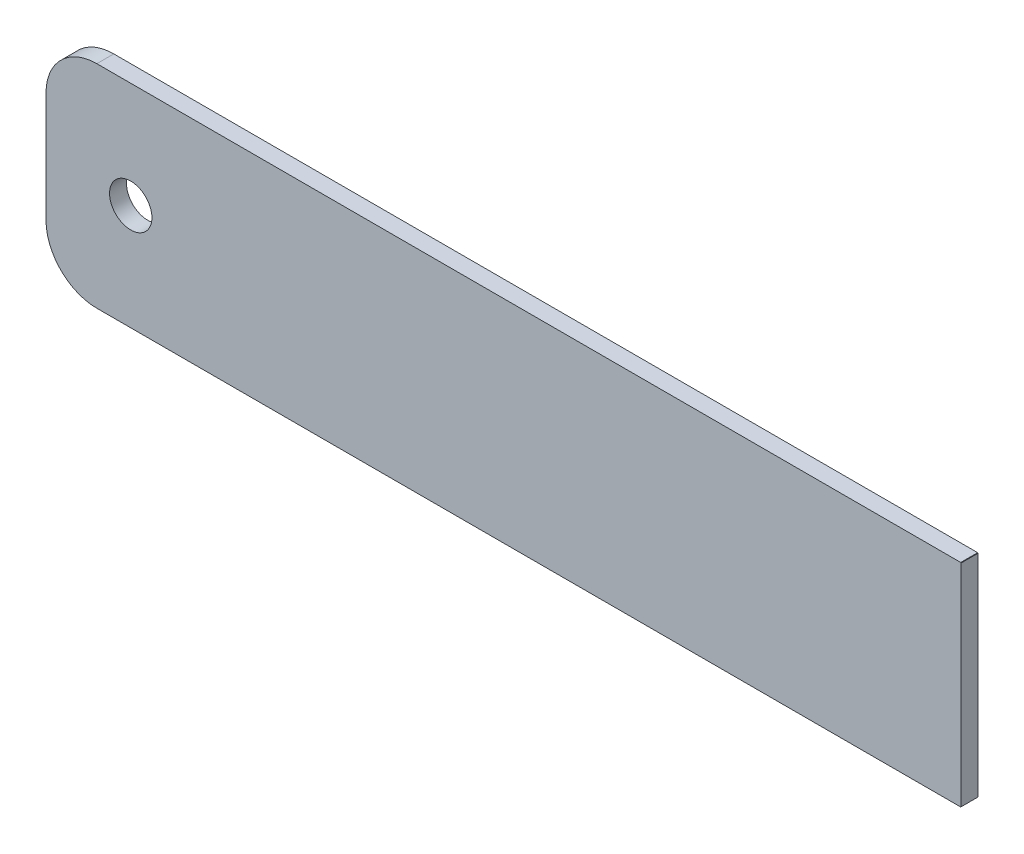
ISO-10303-21;
HEADER;
FILE_DESCRIPTION(('STEP AP214'),'2;1');
FILE_NAME('part.step','',(''),(''),'','','');
FILE_SCHEMA(('AUTOMOTIVE_DESIGN { 1 0 10303 214 1 1 1 1 }'));
ENDSEC;
DATA;
#1=APPLICATION_CONTEXT('core data for automotive mechanical design processes');
#2=APPLICATION_PROTOCOL_DEFINITION('international standard','automotive_design',2000,#1);
#3=PRODUCT_CONTEXT('',#1,'mechanical');
#4=PRODUCT('Part','Part','',(#3));
#5=PRODUCT_RELATED_PRODUCT_CATEGORY('part','',(#4));
#6=PRODUCT_DEFINITION_FORMATION('','',#4);
#7=PRODUCT_DEFINITION_CONTEXT('part definition',#1,'design');
#8=PRODUCT_DEFINITION('design','',#6,#7);
#9=PRODUCT_DEFINITION_SHAPE('','',#8);
#10=(LENGTH_UNIT() NAMED_UNIT(*) SI_UNIT(.MILLI.,.METRE.));
#11=(NAMED_UNIT(*) PLANE_ANGLE_UNIT() SI_UNIT($,.RADIAN.));
#12=(NAMED_UNIT(*) SI_UNIT($,.STERADIAN.) SOLID_ANGLE_UNIT());
#13=UNCERTAINTY_MEASURE_WITH_UNIT(LENGTH_MEASURE(1.E-05),#10,'distance_accuracy_value','');
#14=(GEOMETRIC_REPRESENTATION_CONTEXT(3) GLOBAL_UNCERTAINTY_ASSIGNED_CONTEXT((#13)) GLOBAL_UNIT_ASSIGNED_CONTEXT((#10,
#11,#12)) REPRESENTATION_CONTEXT('',''));
#15=CARTESIAN_POINT('',(0.,0.,0.));
#16=DIRECTION('',(0.,0.,1.));
#17=DIRECTION('',(1.,0.,0.));
#18=AXIS2_PLACEMENT_3D('',#15,#16,#17);
#19=CARTESIAN_POINT('',(-64.77,12.065,1.27));
#20=DIRECTION('',(0.,0.,1.));
#21=DIRECTION('',(1.,0.,0.));
#22=AXIS2_PLACEMENT_3D('',#19,#20,#21);
#23=PLANE('',#22);
#24=CARTESIAN_POINT('',(-64.77,12.065,1.27));
#25=DIRECTION('',(0.,0.,1.));
#26=DIRECTION('',(1.,0.,0.));
#27=AXIS2_PLACEMENT_3D('',#24,#25,#26);
#28=CIRCLE('',#27,3.81);
#29=CARTESIAN_POINT('',(-64.77,15.875,1.27));
#30=VERTEX_POINT('',#29);
#31=CARTESIAN_POINT('',(-68.58,12.065,1.27));
#32=VERTEX_POINT('',#31);
#33=EDGE_CURVE('E147',#30,#32,#28,.T.);
#34=ORIENTED_EDGE('',*,*,#33,.T.);
#35=DIRECTION('',(0.,-1.,0.));
#36=VECTOR('',#35,1.);
#37=CARTESIAN_POINT('',(-68.58,3.80999999999999,1.27));
#38=LINE('',#37,#36);
#39=CARTESIAN_POINT('',(-68.58,3.80999999999999,1.27));
#40=VERTEX_POINT('',#39);
#41=EDGE_CURVE('E95',#32,#40,#38,.T.);
#42=ORIENTED_EDGE('',*,*,#41,.T.);
#43=CARTESIAN_POINT('',(-64.77,3.80999999999999,1.27));
#44=DIRECTION('',(0.,0.,1.));
#45=DIRECTION('',(-1.,0.,0.));
#46=AXIS2_PLACEMENT_3D('',#43,#44,#45);
#47=CIRCLE('',#46,3.81);
#48=CARTESIAN_POINT('',(-64.77,0.,1.27));
#49=VERTEX_POINT('',#48);
#50=EDGE_CURVE('E162',#40,#49,#47,.T.);
#51=ORIENTED_EDGE('',*,*,#50,.T.);
#52=DIRECTION('',(1.,0.,0.));
#53=VECTOR('',#52,1.);
#54=CARTESIAN_POINT('',(-0.0254,0.,1.27));
#55=LINE('',#54,#53);
#56=CARTESIAN_POINT('',(-0.0254,0.,1.27));
#57=VERTEX_POINT('',#56);
#58=EDGE_CURVE('E175',#49,#57,#55,.T.);
#59=ORIENTED_EDGE('',*,*,#58,.T.);
#60=DIRECTION('',(0.707106781186549,0.707106781186546,0.));
#61=VECTOR('',#60,1.);
#62=CARTESIAN_POINT('',(-0.0254,0.,1.27));
#63=LINE('',#62,#61);
#64=CARTESIAN_POINT('',(0.,0.0254,1.27));
#65=VERTEX_POINT('',#64);
#66=EDGE_CURVE('E114',#57,#65,#63,.T.);
#67=ORIENTED_EDGE('',*,*,#66,.T.);
#68=DIRECTION('',(0.,1.,0.));
#69=VECTOR('',#68,1.);
#70=CARTESIAN_POINT('',(0.,0.0254,1.27));
#71=LINE('',#70,#69);
#72=CARTESIAN_POINT('',(0.,15.8496,1.27));
#73=VERTEX_POINT('',#72);
#74=EDGE_CURVE('E108',#65,#73,#71,.T.);
#75=ORIENTED_EDGE('',*,*,#74,.T.);
#76=DIRECTION('',(-0.70710678118657,0.707106781186525,0.));
#77=VECTOR('',#76,1.);
#78=CARTESIAN_POINT('',(0.,15.8496,1.27));
#79=LINE('',#78,#77);
#80=CARTESIAN_POINT('',(-0.0254,15.875,1.27));
#81=VERTEX_POINT('',#80);
#82=EDGE_CURVE('E112',#73,#81,#79,.T.);
#83=ORIENTED_EDGE('',*,*,#82,.T.);
#84=DIRECTION('',(-1.,0.,0.));
#85=VECTOR('',#84,1.);
#86=CARTESIAN_POINT('',(-0.0254,15.875,1.27));
#87=LINE('',#86,#85);
#88=EDGE_CURVE('E52',#81,#30,#87,.T.);
#89=ORIENTED_EDGE('',*,*,#88,.T.);
#90=EDGE_LOOP('',(#34,#42,#51,#59,#67,#75,#83,#89));
#91=FACE_BOUND('',#90,.T.);
#92=CARTESIAN_POINT('',(-62.23,7.9375,1.27));
#93=DIRECTION('',(0.,0.,1.));
#94=DIRECTION('',(1.,0.,0.));
#95=AXIS2_PLACEMENT_3D('',#92,#93,#94);
#96=CIRCLE('',#95,1.5875);
#97=CARTESIAN_POINT('',(-60.6425,7.9375,1.27));
#98=VERTEX_POINT('',#97);
#99=EDGE_CURVE('E136',#98,#98,#96,.T.);
#100=ORIENTED_EDGE('',*,*,#99,.F.);
#101=EDGE_LOOP('',(#100));
#102=FACE_BOUND('',#101,.T.);
#103=ADVANCED_FACE('F35',(#91,#102),#23,.T.);
#104=CARTESIAN_POINT('',(-64.77,12.065,0.));
#105=DIRECTION('',(0.,0.,1.));
#106=DIRECTION('',(1.,0.,0.));
#107=AXIS2_PLACEMENT_3D('',#104,#105,#106);
#108=PLANE('',#107);
#109=CARTESIAN_POINT('',(-64.77,12.065,0.));
#110=DIRECTION('',(0.,0.,1.));
#111=DIRECTION('',(1.,0.,0.));
#112=AXIS2_PLACEMENT_3D('',#109,#110,#111);
#113=CIRCLE('',#112,3.81);
#114=CARTESIAN_POINT('',(-64.77,15.875,0.));
#115=VERTEX_POINT('',#114);
#116=CARTESIAN_POINT('',(-68.58,12.065,0.));
#117=VERTEX_POINT('',#116);
#118=EDGE_CURVE('E132',#115,#117,#113,.T.);
#119=ORIENTED_EDGE('',*,*,#118,.F.);
#120=DIRECTION('',(-1.,0.,0.));
#121=VECTOR('',#120,1.);
#122=CARTESIAN_POINT('',(-0.0254,15.875,0.));
#123=LINE('',#122,#121);
#124=CARTESIAN_POINT('',(-0.0254,15.875,0.));
#125=VERTEX_POINT('',#124);
#126=EDGE_CURVE('E87',#125,#115,#123,.T.);
#127=ORIENTED_EDGE('',*,*,#126,.F.);
#128=DIRECTION('',(-0.70710678118657,0.707106781186525,0.));
#129=VECTOR('',#128,1.);
#130=CARTESIAN_POINT('',(0.,15.8496,0.));
#131=LINE('',#130,#129);
#132=CARTESIAN_POINT('',(0.,15.8496,0.));
#133=VERTEX_POINT('',#132);
#134=EDGE_CURVE('E81',#133,#125,#131,.T.);
#135=ORIENTED_EDGE('',*,*,#134,.F.);
#136=DIRECTION('',(0.,1.,0.));
#137=VECTOR('',#136,1.);
#138=CARTESIAN_POINT('',(0.,0.0254,0.));
#139=LINE('',#138,#137);
#140=CARTESIAN_POINT('',(0.,0.0254,0.));
#141=VERTEX_POINT('',#140);
#142=EDGE_CURVE('E122',#141,#133,#139,.T.);
#143=ORIENTED_EDGE('',*,*,#142,.F.);
#144=DIRECTION('',(0.707106781186549,0.707106781186546,0.));
#145=VECTOR('',#144,1.);
#146=CARTESIAN_POINT('',(-0.0254,0.,0.));
#147=LINE('',#146,#145);
#148=CARTESIAN_POINT('',(-0.0254,0.,0.));
#149=VERTEX_POINT('',#148);
#150=EDGE_CURVE('E142',#149,#141,#147,.T.);
#151=ORIENTED_EDGE('',*,*,#150,.F.);
#152=DIRECTION('',(1.,0.,0.));
#153=VECTOR('',#152,1.);
#154=CARTESIAN_POINT('',(-0.0254,0.,0.));
#155=LINE('',#154,#153);
#156=CARTESIAN_POINT('',(-64.77,0.,0.));
#157=VERTEX_POINT('',#156);
#158=EDGE_CURVE('E140',#157,#149,#155,.T.);
#159=ORIENTED_EDGE('',*,*,#158,.F.);
#160=CARTESIAN_POINT('',(-64.77,3.80999999999999,0.));
#161=DIRECTION('',(0.,0.,1.));
#162=DIRECTION('',(-1.,0.,0.));
#163=AXIS2_PLACEMENT_3D('',#160,#161,#162);
#164=CIRCLE('',#163,3.81);
#165=CARTESIAN_POINT('',(-68.58,3.80999999999999,0.));
#166=VERTEX_POINT('',#165);
#167=EDGE_CURVE('E138',#166,#157,#164,.T.);
#168=ORIENTED_EDGE('',*,*,#167,.F.);
#169=DIRECTION('',(0.,-1.,0.));
#170=VECTOR('',#169,1.);
#171=CARTESIAN_POINT('',(-68.58,3.80999999999999,0.));
#172=LINE('',#171,#170);
#173=EDGE_CURVE('E135',#117,#166,#172,.T.);
#174=ORIENTED_EDGE('',*,*,#173,.F.);
#175=EDGE_LOOP('',(#119,#127,#135,#143,#151,#159,#168,#174));
#176=FACE_BOUND('',#175,.T.);
#177=CARTESIAN_POINT('',(-62.23,7.9375,0.));
#178=DIRECTION('',(0.,0.,1.));
#179=DIRECTION('',(1.,0.,0.));
#180=AXIS2_PLACEMENT_3D('',#177,#178,#179);
#181=CIRCLE('',#180,1.5875);
#182=CARTESIAN_POINT('',(-60.6425,7.9375,0.));
#183=VERTEX_POINT('',#182);
#184=EDGE_CURVE('E181',#183,#183,#181,.T.);
#185=ORIENTED_EDGE('',*,*,#184,.T.);
#186=EDGE_LOOP('',(#185));
#187=FACE_BOUND('',#186,.T.);
#188=ADVANCED_FACE('F166',(#176,#187),#108,.F.);
#189=CARTESIAN_POINT('',(-64.77,12.065,1.27));
#190=DIRECTION('',(0.,0.,-1.));
#191=DIRECTION('',(-1.,0.,0.));
#192=AXIS2_PLACEMENT_3D('',#189,#190,#191);
#193=CYLINDRICAL_SURFACE('',#192,3.81);
#194=ORIENTED_EDGE('',*,*,#118,.T.);
#195=DIRECTION('',(0.,0.,-1.));
#196=VECTOR('',#195,1.);
#197=CARTESIAN_POINT('',(-68.58,12.065,1.27));
#198=LINE('',#197,#196);
#199=EDGE_CURVE('E11',#32,#117,#198,.T.);
#200=ORIENTED_EDGE('',*,*,#199,.F.);
#201=ORIENTED_EDGE('',*,*,#33,.F.);
#202=DIRECTION('',(0.,0.,-1.));
#203=VECTOR('',#202,1.);
#204=CARTESIAN_POINT('',(-64.77,15.875,1.27));
#205=LINE('',#204,#203);
#206=EDGE_CURVE('E128',#30,#115,#205,.T.);
#207=ORIENTED_EDGE('',*,*,#206,.T.);
#208=EDGE_LOOP('',(#194,#200,#201,#207));
#209=FACE_BOUND('',#208,.T.);
#210=ADVANCED_FACE('F37',(#209),#193,.T.);
#211=CARTESIAN_POINT('',(-68.58,3.80999999999999,1.27));
#212=DIRECTION('',(1.,0.,0.));
#213=DIRECTION('',(0.,1.,0.));
#214=AXIS2_PLACEMENT_3D('',#211,#212,#213);
#215=PLANE('',#214);
#216=ORIENTED_EDGE('',*,*,#173,.T.);
#217=DIRECTION('',(0.,0.,-1.));
#218=VECTOR('',#217,1.);
#219=CARTESIAN_POINT('',(-68.58,3.80999999999999,1.27));
#220=LINE('',#219,#218);
#221=EDGE_CURVE('E44',#40,#166,#220,.T.);
#222=ORIENTED_EDGE('',*,*,#221,.F.);
#223=ORIENTED_EDGE('',*,*,#41,.F.);
#224=ORIENTED_EDGE('',*,*,#199,.T.);
#225=EDGE_LOOP('',(#216,#222,#223,#224));
#226=FACE_BOUND('',#225,.T.);
#227=ADVANCED_FACE('F209',(#226),#215,.F.);
#228=CARTESIAN_POINT('',(-64.77,3.80999999999999,1.27));
#229=DIRECTION('',(0.,0.,-1.));
#230=DIRECTION('',(-1.,0.,0.));
#231=AXIS2_PLACEMENT_3D('',#228,#229,#230);
#232=CYLINDRICAL_SURFACE('',#231,3.81);
#233=ORIENTED_EDGE('',*,*,#167,.T.);
#234=DIRECTION('',(0.,0.,-1.));
#235=VECTOR('',#234,1.);
#236=CARTESIAN_POINT('',(-64.77,0.,1.27));
#237=LINE('',#236,#235);
#238=EDGE_CURVE('E154',#49,#157,#237,.T.);
#239=ORIENTED_EDGE('',*,*,#238,.F.);
#240=ORIENTED_EDGE('',*,*,#50,.F.);
#241=ORIENTED_EDGE('',*,*,#221,.T.);
#242=EDGE_LOOP('',(#233,#239,#240,#241));
#243=FACE_BOUND('',#242,.T.);
#244=ADVANCED_FACE('F160',(#243),#232,.T.);
#245=CARTESIAN_POINT('',(-0.0254,0.,1.27));
#246=DIRECTION('',(0.,1.,0.));
#247=DIRECTION('',(-1.,0.,0.));
#248=AXIS2_PLACEMENT_3D('',#245,#246,#247);
#249=PLANE('',#248);
#250=ORIENTED_EDGE('',*,*,#158,.T.);
#251=DIRECTION('',(0.,0.,-1.));
#252=VECTOR('',#251,1.);
#253=CARTESIAN_POINT('',(-0.0254,0.,1.27));
#254=LINE('',#253,#252);
#255=EDGE_CURVE('E151',#57,#149,#254,.T.);
#256=ORIENTED_EDGE('',*,*,#255,.F.);
#257=ORIENTED_EDGE('',*,*,#58,.F.);
#258=ORIENTED_EDGE('',*,*,#238,.T.);
#259=EDGE_LOOP('',(#250,#256,#257,#258));
#260=FACE_BOUND('',#259,.T.);
#261=ADVANCED_FACE('F171',(#260),#249,.F.);
#262=CARTESIAN_POINT('',(-0.0254,0.,1.27));
#263=DIRECTION('',(-0.707106781186546,0.707106781186549,0.));
#264=DIRECTION('',(-0.707106781186549,-0.707106781186546,0.));
#265=AXIS2_PLACEMENT_3D('',#262,#263,#264);
#266=PLANE('',#265);
#267=ORIENTED_EDGE('',*,*,#150,.T.);
#268=DIRECTION('',(0.,0.,-1.));
#269=VECTOR('',#268,1.);
#270=CARTESIAN_POINT('',(0.,0.0254,1.27));
#271=LINE('',#270,#269);
#272=EDGE_CURVE('E123',#65,#141,#271,.T.);
#273=ORIENTED_EDGE('',*,*,#272,.F.);
#274=ORIENTED_EDGE('',*,*,#66,.F.);
#275=ORIENTED_EDGE('',*,*,#255,.T.);
#276=EDGE_LOOP('',(#267,#273,#274,#275));
#277=FACE_BOUND('',#276,.T.);
#278=ADVANCED_FACE('F174',(#277),#266,.F.);
#279=CARTESIAN_POINT('',(0.,0.0254,1.27));
#280=DIRECTION('',(-1.,0.,0.));
#281=DIRECTION('',(0.,0.,1.));
#282=AXIS2_PLACEMENT_3D('',#279,#280,#281);
#283=PLANE('',#282);
#284=ORIENTED_EDGE('',*,*,#142,.T.);
#285=DIRECTION('',(0.,0.,-1.));
#286=VECTOR('',#285,1.);
#287=CARTESIAN_POINT('',(0.,15.8496,1.27));
#288=LINE('',#287,#286);
#289=EDGE_CURVE('E119',#73,#133,#288,.T.);
#290=ORIENTED_EDGE('',*,*,#289,.F.);
#291=ORIENTED_EDGE('',*,*,#74,.F.);
#292=ORIENTED_EDGE('',*,*,#272,.T.);
#293=EDGE_LOOP('',(#284,#290,#291,#292));
#294=FACE_BOUND('',#293,.T.);
#295=ADVANCED_FACE('F120',(#294),#283,.F.);
#296=CARTESIAN_POINT('',(0.,15.8496,1.27));
#297=DIRECTION('',(-0.707106781186525,-0.70710678118657,0.));
#298=DIRECTION('',(0.70710678118657,-0.707106781186525,0.));
#299=AXIS2_PLACEMENT_3D('',#296,#297,#298);
#300=PLANE('',#299);
#301=ORIENTED_EDGE('',*,*,#134,.T.);
#302=DIRECTION('',(0.,0.,-1.));
#303=VECTOR('',#302,1.);
#304=CARTESIAN_POINT('',(-0.0254,15.875,1.27));
#305=LINE('',#304,#303);
#306=EDGE_CURVE('E124',#81,#125,#305,.T.);
#307=ORIENTED_EDGE('',*,*,#306,.F.);
#308=ORIENTED_EDGE('',*,*,#82,.F.);
#309=ORIENTED_EDGE('',*,*,#289,.T.);
#310=EDGE_LOOP('',(#301,#307,#308,#309));
#311=FACE_BOUND('',#310,.T.);
#312=ADVANCED_FACE('F126',(#311),#300,.F.);
#313=CARTESIAN_POINT('',(-0.0254,15.875,1.27));
#314=DIRECTION('',(0.,-1.,0.));
#315=DIRECTION('',(1.,0.,0.));
#316=AXIS2_PLACEMENT_3D('',#313,#314,#315);
#317=PLANE('',#316);
#318=ORIENTED_EDGE('',*,*,#126,.T.);
#319=ORIENTED_EDGE('',*,*,#206,.F.);
#320=ORIENTED_EDGE('',*,*,#88,.F.);
#321=ORIENTED_EDGE('',*,*,#306,.T.);
#322=EDGE_LOOP('',(#318,#319,#320,#321));
#323=FACE_BOUND('',#322,.T.);
#324=ADVANCED_FACE('F197',(#323),#317,.F.);
#325=CARTESIAN_POINT('',(-62.23,7.9375,1.27));
#326=DIRECTION('',(0.,0.,-1.));
#327=DIRECTION('',(-1.,0.,0.));
#328=AXIS2_PLACEMENT_3D('',#325,#326,#327);
#329=CYLINDRICAL_SURFACE('',#328,1.5875);
#330=ORIENTED_EDGE('',*,*,#99,.T.);
#331=EDGE_LOOP('',(#330));
#332=FACE_BOUND('',#331,.T.);
#333=ORIENTED_EDGE('',*,*,#184,.F.);
#334=EDGE_LOOP('',(#333));
#335=FACE_BOUND('',#334,.T.);
#336=ADVANCED_FACE('F187',(#332,#335),#329,.F.);
#337=CLOSED_SHELL('',(#103,#188,#210,#227,#244,#261,#278,#295,#312,#324,#336));
#338=MANIFOLD_SOLID_BREP('B2',#337);
#339=ADVANCED_BREP_SHAPE_REPRESENTATION('',(#18,#338),#14);
#340=SHAPE_DEFINITION_REPRESENTATION(#9,#339);
ENDSEC;
END-ISO-10303-21;
